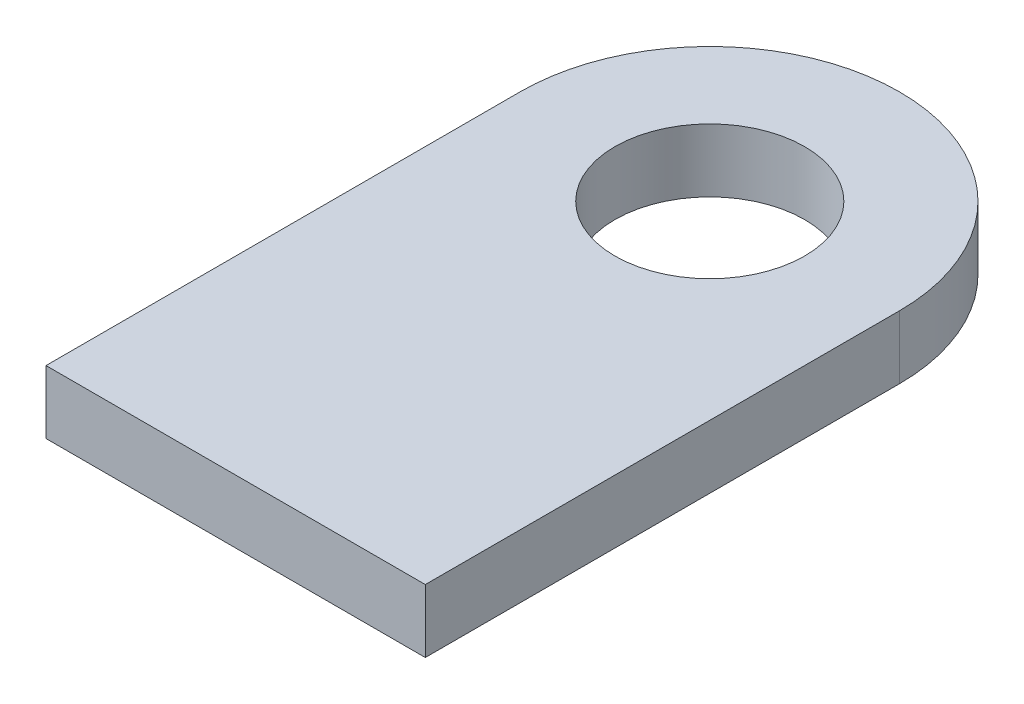
ISO-10303-21;
HEADER;
FILE_DESCRIPTION(('STEP AP214'),'2;1');
FILE_NAME('part.step','',(''),(''),'','','');
FILE_SCHEMA(('AUTOMOTIVE_DESIGN { 1 0 10303 214 1 1 1 1 }'));
ENDSEC;
DATA;
#1=APPLICATION_CONTEXT('core data for automotive mechanical design processes');
#2=APPLICATION_PROTOCOL_DEFINITION('international standard','automotive_design',2000,#1);
#3=PRODUCT_CONTEXT('',#1,'mechanical');
#4=PRODUCT('Part','Part','',(#3));
#5=PRODUCT_RELATED_PRODUCT_CATEGORY('part','',(#4));
#6=PRODUCT_DEFINITION_FORMATION('','',#4);
#7=PRODUCT_DEFINITION_CONTEXT('part definition',#1,'design');
#8=PRODUCT_DEFINITION('design','',#6,#7);
#9=PRODUCT_DEFINITION_SHAPE('','',#8);
#10=(LENGTH_UNIT() NAMED_UNIT(*) SI_UNIT(.MILLI.,.METRE.));
#11=(NAMED_UNIT(*) PLANE_ANGLE_UNIT() SI_UNIT($,.RADIAN.));
#12=(NAMED_UNIT(*) SI_UNIT($,.STERADIAN.) SOLID_ANGLE_UNIT());
#13=UNCERTAINTY_MEASURE_WITH_UNIT(LENGTH_MEASURE(1.E-05),#10,'distance_accuracy_value','');
#14=(GEOMETRIC_REPRESENTATION_CONTEXT(3) GLOBAL_UNCERTAINTY_ASSIGNED_CONTEXT((#13)) GLOBAL_UNIT_ASSIGNED_CONTEXT((#10,
#11,#12)) REPRESENTATION_CONTEXT('',''));
#15=CARTESIAN_POINT('',(0.,0.,0.));
#16=DIRECTION('',(0.,0.,1.));
#17=DIRECTION('',(1.,0.,0.));
#18=AXIS2_PLACEMENT_3D('',#15,#16,#17);
#19=CARTESIAN_POINT('',(0.,2.,0.));
#20=DIRECTION('',(0.,-1.,0.));
#21=DIRECTION('',(0.,0.,-1.));
#22=AXIS2_PLACEMENT_3D('',#19,#20,#21);
#23=PLANE('',#22);
#24=CARTESIAN_POINT('',(0.,2.,0.));
#25=DIRECTION('',(0.,1.,0.));
#26=DIRECTION('',(0.,0.,-1.));
#27=AXIS2_PLACEMENT_3D('',#24,#25,#26);
#28=CIRCLE('',#27,6.);
#29=CARTESIAN_POINT('',(6.,2.,0.));
#30=VERTEX_POINT('',#29);
#31=CARTESIAN_POINT('',(-6.,2.,0.));
#32=VERTEX_POINT('',#31);
#33=EDGE_CURVE('E86',#30,#32,#28,.T.);
#34=ORIENTED_EDGE('',*,*,#33,.T.);
#35=DIRECTION('',(0.,0.,1.));
#36=VECTOR('',#35,1.);
#37=CARTESIAN_POINT('',(-6.,2.,0.));
#38=LINE('',#37,#36);
#39=CARTESIAN_POINT('',(-6.,2.,15.));
#40=VERTEX_POINT('',#39);
#41=EDGE_CURVE('E81',#32,#40,#38,.T.);
#42=ORIENTED_EDGE('',*,*,#41,.T.);
#43=DIRECTION('',(1.,0.,0.));
#44=VECTOR('',#43,1.);
#45=CARTESIAN_POINT('',(6.,2.,15.));
#46=LINE('',#45,#44);
#47=CARTESIAN_POINT('',(6.,2.,15.));
#48=VERTEX_POINT('',#47);
#49=EDGE_CURVE('E84',#40,#48,#46,.T.);
#50=ORIENTED_EDGE('',*,*,#49,.T.);
#51=DIRECTION('',(0.,0.,-1.));
#52=VECTOR('',#51,1.);
#53=CARTESIAN_POINT('',(6.,2.,0.));
#54=LINE('',#53,#52);
#55=EDGE_CURVE('E51',#48,#30,#54,.T.);
#56=ORIENTED_EDGE('',*,*,#55,.T.);
#57=EDGE_LOOP('',(#34,#42,#50,#56));
#58=FACE_BOUND('',#57,.T.);
#59=CARTESIAN_POINT('',(0.,2.,0.));
#60=DIRECTION('',(0.,1.,0.));
#61=DIRECTION('',(0.,0.,1.));
#62=AXIS2_PLACEMENT_3D('',#59,#60,#61);
#63=CIRCLE('',#62,3.00000000000001);
#64=CARTESIAN_POINT('',(0.,2.,3.00000000000001));
#65=VERTEX_POINT('',#64);
#66=EDGE_CURVE('E114',#65,#65,#63,.T.);
#67=ORIENTED_EDGE('',*,*,#66,.F.);
#68=EDGE_LOOP('',(#67));
#69=FACE_BOUND('',#68,.T.);
#70=ADVANCED_FACE('F34',(#58,#69),#23,.F.);
#71=CARTESIAN_POINT('',(0.,2.,0.));
#72=DIRECTION('',(0.,-1.,0.));
#73=DIRECTION('',(0.,0.,-1.));
#74=AXIS2_PLACEMENT_3D('',#71,#72,#73);
#75=CYLINDRICAL_SURFACE('',#74,6.);
#76=CARTESIAN_POINT('',(0.,0.,0.));
#77=DIRECTION('',(0.,1.,0.));
#78=DIRECTION('',(0.,0.,-1.));
#79=AXIS2_PLACEMENT_3D('',#76,#77,#78);
#80=CIRCLE('',#79,6.);
#81=CARTESIAN_POINT('',(6.,0.,0.));
#82=VERTEX_POINT('',#81);
#83=CARTESIAN_POINT('',(-6.,0.,0.));
#84=VERTEX_POINT('',#83);
#85=EDGE_CURVE('E98',#82,#84,#80,.T.);
#86=ORIENTED_EDGE('',*,*,#85,.T.);
#87=DIRECTION('',(0.,-1.,0.));
#88=VECTOR('',#87,1.);
#89=CARTESIAN_POINT('',(-6.,2.,0.));
#90=LINE('',#89,#88);
#91=EDGE_CURVE('E11',#32,#84,#90,.T.);
#92=ORIENTED_EDGE('',*,*,#91,.F.);
#93=ORIENTED_EDGE('',*,*,#33,.F.);
#94=DIRECTION('',(0.,-1.,0.));
#95=VECTOR('',#94,1.);
#96=CARTESIAN_POINT('',(6.,2.,0.));
#97=LINE('',#96,#95);
#98=EDGE_CURVE('E94',#30,#82,#97,.T.);
#99=ORIENTED_EDGE('',*,*,#98,.T.);
#100=EDGE_LOOP('',(#86,#92,#93,#99));
#101=FACE_BOUND('',#100,.T.);
#102=ADVANCED_FACE('F36',(#101),#75,.T.);
#103=CARTESIAN_POINT('',(-6.,2.,0.));
#104=DIRECTION('',(1.,0.,0.));
#105=DIRECTION('',(0.,0.,-1.));
#106=AXIS2_PLACEMENT_3D('',#103,#104,#105);
#107=PLANE('',#106);
#108=DIRECTION('',(0.,0.,1.));
#109=VECTOR('',#108,1.);
#110=CARTESIAN_POINT('',(-6.,0.,0.));
#111=LINE('',#110,#109);
#112=CARTESIAN_POINT('',(-6.,0.,15.));
#113=VERTEX_POINT('',#112);
#114=EDGE_CURVE('E90',#84,#113,#111,.T.);
#115=ORIENTED_EDGE('',*,*,#114,.T.);
#116=DIRECTION('',(0.,-1.,0.));
#117=VECTOR('',#116,1.);
#118=CARTESIAN_POINT('',(-6.,2.,15.));
#119=LINE('',#118,#117);
#120=EDGE_CURVE('E43',#40,#113,#119,.T.);
#121=ORIENTED_EDGE('',*,*,#120,.F.);
#122=ORIENTED_EDGE('',*,*,#41,.F.);
#123=ORIENTED_EDGE('',*,*,#91,.T.);
#124=EDGE_LOOP('',(#115,#121,#122,#123));
#125=FACE_BOUND('',#124,.T.);
#126=ADVANCED_FACE('F89',(#125),#107,.F.);
#127=CARTESIAN_POINT('',(6.,2.,15.));
#128=DIRECTION('',(0.,0.,-1.));
#129=DIRECTION('',(-1.,0.,0.));
#130=AXIS2_PLACEMENT_3D('',#127,#128,#129);
#131=PLANE('',#130);
#132=DIRECTION('',(1.,0.,0.));
#133=VECTOR('',#132,1.);
#134=CARTESIAN_POINT('',(6.,0.,15.));
#135=LINE('',#134,#133);
#136=CARTESIAN_POINT('',(6.,0.,15.));
#137=VERTEX_POINT('',#136);
#138=EDGE_CURVE('E68',#113,#137,#135,.T.);
#139=ORIENTED_EDGE('',*,*,#138,.T.);
#140=DIRECTION('',(0.,-1.,0.));
#141=VECTOR('',#140,1.);
#142=CARTESIAN_POINT('',(6.,2.,15.));
#143=LINE('',#142,#141);
#144=EDGE_CURVE('E91',#48,#137,#143,.T.);
#145=ORIENTED_EDGE('',*,*,#144,.F.);
#146=ORIENTED_EDGE('',*,*,#49,.F.);
#147=ORIENTED_EDGE('',*,*,#120,.T.);
#148=EDGE_LOOP('',(#139,#145,#146,#147));
#149=FACE_BOUND('',#148,.T.);
#150=ADVANCED_FACE('F92',(#149),#131,.F.);
#151=CARTESIAN_POINT('',(6.,2.,0.));
#152=DIRECTION('',(-1.,0.,0.));
#153=DIRECTION('',(0.,0.,1.));
#154=AXIS2_PLACEMENT_3D('',#151,#152,#153);
#155=PLANE('',#154);
#156=DIRECTION('',(0.,0.,-1.));
#157=VECTOR('',#156,1.);
#158=CARTESIAN_POINT('',(6.,0.,0.));
#159=LINE('',#158,#157);
#160=EDGE_CURVE('E74',#137,#82,#159,.T.);
#161=ORIENTED_EDGE('',*,*,#160,.T.);
#162=ORIENTED_EDGE('',*,*,#98,.F.);
#163=ORIENTED_EDGE('',*,*,#55,.F.);
#164=ORIENTED_EDGE('',*,*,#144,.T.);
#165=EDGE_LOOP('',(#161,#162,#163,#164));
#166=FACE_BOUND('',#165,.T.);
#167=ADVANCED_FACE('F106',(#166),#155,.F.);
#168=CARTESIAN_POINT('',(0.,0.,0.));
#169=DIRECTION('',(0.,-1.,0.));
#170=DIRECTION('',(0.,0.,-1.));
#171=AXIS2_PLACEMENT_3D('',#168,#169,#170);
#172=PLANE('',#171);
#173=CARTESIAN_POINT('',(0.,0.,0.));
#174=DIRECTION('',(0.,-1.,0.));
#175=DIRECTION('',(0.,0.,-1.));
#176=AXIS2_PLACEMENT_3D('',#173,#174,#175);
#177=CIRCLE('',#176,3.00000000000001);
#178=CARTESIAN_POINT('',(0.,0.,-3.00000000000001));
#179=VERTEX_POINT('',#178);
#180=EDGE_CURVE('E101',#179,#179,#177,.T.);
#181=ORIENTED_EDGE('',*,*,#180,.F.);
#182=EDGE_LOOP('',(#181));
#183=FACE_BOUND('',#182,.T.);
#184=ORIENTED_EDGE('',*,*,#85,.F.);
#185=ORIENTED_EDGE('',*,*,#160,.F.);
#186=ORIENTED_EDGE('',*,*,#138,.F.);
#187=ORIENTED_EDGE('',*,*,#114,.F.);
#188=EDGE_LOOP('',(#184,#185,#186,#187));
#189=FACE_BOUND('',#188,.T.);
#190=ADVANCED_FACE('F109',(#183,#189),#172,.T.);
#191=CARTESIAN_POINT('',(0.,2.,0.));
#192=DIRECTION('',(0.,1.,0.));
#193=DIRECTION('',(0.,0.,1.));
#194=AXIS2_PLACEMENT_3D('',#191,#192,#193);
#195=CYLINDRICAL_SURFACE('',#194,3.00000000000001);
#196=ORIENTED_EDGE('',*,*,#66,.T.);
#197=EDGE_LOOP('',(#196));
#198=FACE_BOUND('',#197,.T.);
#199=ORIENTED_EDGE('',*,*,#180,.T.);
#200=EDGE_LOOP('',(#199));
#201=FACE_BOUND('',#200,.T.);
#202=ADVANCED_FACE('F118',(#198,#201),#195,.F.);
#203=CLOSED_SHELL('',(#70,#102,#126,#150,#167,#190,#202));
#204=MANIFOLD_SOLID_BREP('B2',#203);
#205=ADVANCED_BREP_SHAPE_REPRESENTATION('',(#18,#204),#14);
#206=SHAPE_DEFINITION_REPRESENTATION(#9,#205);
ENDSEC;
END-ISO-10303-21;
